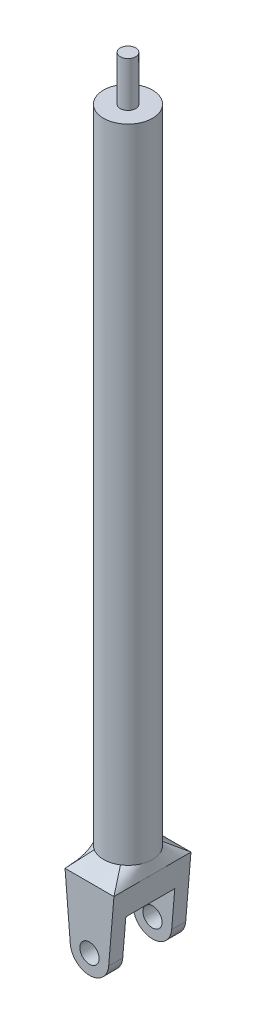
ISO-10303-21;
HEADER;
FILE_DESCRIPTION(('STEP AP214'),'2;1');
FILE_NAME('part.step','',(''),(''),'','','');
FILE_SCHEMA(('AUTOMOTIVE_DESIGN { 1 0 10303 214 1 1 1 1 }'));
ENDSEC;
DATA;
#1=APPLICATION_CONTEXT('core data for automotive mechanical design processes');
#2=APPLICATION_PROTOCOL_DEFINITION('international standard','automotive_design',2000,#1);
#3=PRODUCT_CONTEXT('',#1,'mechanical');
#4=PRODUCT('Part','Part','',(#3));
#5=PRODUCT_RELATED_PRODUCT_CATEGORY('part','',(#4));
#6=PRODUCT_DEFINITION_FORMATION('','',#4);
#7=PRODUCT_DEFINITION_CONTEXT('part definition',#1,'design');
#8=PRODUCT_DEFINITION('design','',#6,#7);
#9=PRODUCT_DEFINITION_SHAPE('','',#8);
#10=(LENGTH_UNIT() NAMED_UNIT(*) SI_UNIT(.MILLI.,.METRE.));
#11=(NAMED_UNIT(*) PLANE_ANGLE_UNIT() SI_UNIT($,.RADIAN.));
#12=(NAMED_UNIT(*) SI_UNIT($,.STERADIAN.) SOLID_ANGLE_UNIT());
#13=UNCERTAINTY_MEASURE_WITH_UNIT(LENGTH_MEASURE(1.E-05),#10,'distance_accuracy_value','');
#14=(GEOMETRIC_REPRESENTATION_CONTEXT(3) GLOBAL_UNCERTAINTY_ASSIGNED_CONTEXT((#13)) GLOBAL_UNIT_ASSIGNED_CONTEXT((#10,
#11,#12)) REPRESENTATION_CONTEXT('',''));
#15=CARTESIAN_POINT('',(0.,0.,0.));
#16=DIRECTION('',(0.,0.,1.));
#17=DIRECTION('',(1.,0.,0.));
#18=AXIS2_PLACEMENT_3D('',#15,#16,#17);
#19=CARTESIAN_POINT('',(0.,535.,0.));
#20=DIRECTION('',(0.,1.,0.));
#21=DIRECTION('',(0.,0.,1.));
#22=AXIS2_PLACEMENT_3D('',#19,#20,#21);
#23=PLANE('',#22);
#24=CARTESIAN_POINT('',(0.,535.,0.));
#25=DIRECTION('',(0.,-1.,0.));
#26=DIRECTION('',(0.,0.,-1.));
#27=AXIS2_PLACEMENT_3D('',#24,#25,#26);
#28=CIRCLE('',#27,6.00000000000001);
#29=CARTESIAN_POINT('',(0.,535.,-6.00000000000001));
#30=VERTEX_POINT('',#29);
#31=EDGE_CURVE('E12',#30,#30,#28,.T.);
#32=ORIENTED_EDGE('',*,*,#31,.F.);
#33=EDGE_LOOP('',(#32));
#34=FACE_BOUND('',#33,.T.);
#35=ADVANCED_FACE('F61',(#34),#23,.T.);
#36=CARTESIAN_POINT('',(0.,0.,0.));
#37=DIRECTION('',(0.,-1.,0.));
#38=DIRECTION('',(0.,0.,-1.));
#39=AXIS2_PLACEMENT_3D('',#36,#37,#38);
#40=CYLINDRICAL_SURFACE('',#39,6.00000000000001);
#41=ORIENTED_EDGE('',*,*,#31,.T.);
#42=EDGE_LOOP('',(#41));
#43=FACE_BOUND('',#42,.T.);
#44=CARTESIAN_POINT('',(0.,500.,0.));
#45=DIRECTION('',(0.,-1.,0.));
#46=DIRECTION('',(0.,0.,-1.));
#47=AXIS2_PLACEMENT_3D('',#44,#45,#46);
#48=CIRCLE('',#47,6.00000000000002);
#49=CARTESIAN_POINT('',(0.,500.,-6.00000000000002));
#50=VERTEX_POINT('',#49);
#51=EDGE_CURVE('E70',#50,#50,#48,.T.);
#52=ORIENTED_EDGE('',*,*,#51,.F.);
#53=EDGE_LOOP('',(#52));
#54=FACE_BOUND('',#53,.T.);
#55=ADVANCED_FACE('F470',(#43,#54),#40,.T.);
#56=CARTESIAN_POINT('',(6.00000000000002,500.,0.));
#57=DIRECTION('',(0.,1.,0.));
#58=DIRECTION('',(0.,0.,1.));
#59=AXIS2_PLACEMENT_3D('',#56,#57,#58);
#60=PLANE('',#59);
#61=ORIENTED_EDGE('',*,*,#51,.T.);
#62=EDGE_LOOP('',(#61));
#63=FACE_BOUND('',#62,.T.);
#64=CARTESIAN_POINT('',(0.,500.,0.));
#65=DIRECTION('',(0.,-1.,0.));
#66=DIRECTION('',(0.,0.,-1.));
#67=AXIS2_PLACEMENT_3D('',#64,#65,#66);
#68=CIRCLE('',#67,19.05);
#69=CARTESIAN_POINT('',(0.,500.,-19.05));
#70=VERTEX_POINT('',#69);
#71=EDGE_CURVE('E399',#70,#70,#68,.T.);
#72=ORIENTED_EDGE('',*,*,#71,.F.);
#73=EDGE_LOOP('',(#72));
#74=FACE_BOUND('',#73,.T.);
#75=ADVANCED_FACE('F251',(#63,#74),#60,.T.);
#76=CARTESIAN_POINT('',(0.,0.,0.));
#77=DIRECTION('',(0.,-1.,0.));
#78=DIRECTION('',(0.,0.,-1.));
#79=AXIS2_PLACEMENT_3D('',#76,#77,#78);
#80=CYLINDRICAL_SURFACE('',#79,19.05);
#81=ORIENTED_EDGE('',*,*,#71,.T.);
#82=EDGE_LOOP('',(#81));
#83=FACE_BOUND('',#82,.T.);
#84=CARTESIAN_POINT('',(10.2118646168973,0.,-16.081676562043));
#85=CARTESIAN_POINT('',(11.3431871061631,0.,-15.3632867813592));
#86=CARTESIAN_POINT('',(12.4660261977281,0.,-14.4818953203896));
#87=CARTESIAN_POINT('',(14.5680116148928,0.,-12.3652795690803));
#88=CARTESIAN_POINT('',(15.5460497003018,0.,-11.1290176336145));
#89=CARTESIAN_POINT('',(17.2041251482103,0.,-8.33983049337774));
#90=CARTESIAN_POINT('',(17.8822228053126,0.,-6.78686541606789));
#91=CARTESIAN_POINT('',(18.8059817453631,0.,-3.48862225351627));
#92=CARTESIAN_POINT('',(19.05,0.,-1.74491009896212));
#93=CARTESIAN_POINT('',(19.05,0.,1.74491009896212));
#94=CARTESIAN_POINT('',(18.8059817453631,0.,3.48862225351627));
#95=CARTESIAN_POINT('',(17.8822228053126,0.,6.78686541606789));
#96=CARTESIAN_POINT('',(17.2041251482103,0.,8.33983049337774));
#97=CARTESIAN_POINT('',(15.5460497003018,0.,11.1290176336145));
#98=CARTESIAN_POINT('',(14.5680116148928,0.,12.3652795690803));
#99=CARTESIAN_POINT('',(12.4660261977281,0.,14.4818953203896));
#100=CARTESIAN_POINT('',(11.3431871061631,0.,15.3632867813592));
#101=CARTESIAN_POINT('',(10.2118646168973,0.,16.081676562043));
#102=B_SPLINE_CURVE_WITH_KNOTS('',3,(#84,#85,#86,#87,#88,#89,#90,#91,#92,#93,#94,#95,#96,#97,
#98,#99,#100,#101),.UNSPECIFIED.,.F.,.F.,(4,2,2,2,2,2,2,2,4),(0.,0.125,0.25,0.375,0.5,0.625,
0.75,0.875,1.),.UNSPECIFIED.);
#103=CARTESIAN_POINT('',(10.212798921421,0.,-16.0831521547243));
#104=VERTEX_POINT('',#103);
#105=CARTESIAN_POINT('',(10.2127939620081,0.,16.0831447036037));
#106=VERTEX_POINT('',#105);
#107=EDGE_CURVE('E239',#104,#106,#102,.T.);
#108=ORIENTED_EDGE('',*,*,#107,.F.);
#109=CARTESIAN_POINT('',(-10.2118625327599,0.,-16.08167788547));
#110=CARTESIAN_POINT('',(-9.9103022956757,-1.77030877262962E-05,-16.2731819255062));
#111=CARTESIAN_POINT('',(-9.60334529303369,-0.000111724875320894,-16.4561837942627));
#112=CARTESIAN_POINT('',(-8.97964646000987,-0.000319295086165796,-16.8046402712615));
#113=CARTESIAN_POINT('',(-8.66290508212494,-0.000432842607517498,-16.9700956894083));
#114=CARTESIAN_POINT('',(-8.02062328957559,-0.000546378836732187,-17.2829316376771));
#115=CARTESIAN_POINT('',(-7.69508301533167,-0.000546369355768727,-17.4303124560417));
#116=CARTESIAN_POINT('',(-7.03653073271485,-0.000426982292556745,-17.7064141484739));
#117=CARTESIAN_POINT('',(-6.7035256498919,-0.000307711212491205,-17.8351515539269));
#118=CARTESIAN_POINT('',(-6.03079427158248,-9.89131884952009E-05,-18.0737205550378));
#119=CARTESIAN_POINT('',(-5.69106805425552,-9.3858988918205E-06,-18.1835523704034));
#120=CARTESIAN_POINT('',(-5.17731096160236,3.77917307058388E-06,-18.3338429196899));
#121=CARTESIAN_POINT('',(-5.00536562632922,-1.20193864252876E-05,-18.3815298553339));
#122=CARTESIAN_POINT('',(-4.66016985090057,-3.72723361843981E-05,-18.4720645954542));
#123=CARTESIAN_POINT('',(-4.48691913144452,-4.67253273846111E-05,-18.5149113310384));
#124=CARTESIAN_POINT('',(-3.79159510702793,-5.5417459540569E-05,-18.6765320509707));
#125=CARTESIAN_POINT('',(-3.2648334444383,3.57663684478454E-06,-18.7757863667498));
#126=CARTESIAN_POINT('',(-2.20477242414847,-3.66884300591836E-06,-18.9295635408075));
#127=CARTESIAN_POINT('',(-1.67147221414914,-6.99249217863863E-05,-18.9840805032847));
#128=CARTESIAN_POINT('',(-0.869554771441041,-4.87934567427622E-05,-19.0320304268959));
#129=CARTESIAN_POINT('',(-0.601857857036039,-2.1643115947873E-05,-19.0423745981335));
#130=CARTESIAN_POINT('',(-0.0663252022312551,1.207954298781E-07,-19.0517657835246));
#131=CARTESIAN_POINT('',(0.201510477854582,-5.25647462074756E-06,-19.0508159778472));
#132=CARTESIAN_POINT('',(0.736918396574215,-3.26184824141355E-05,-19.0376251985665));
#133=CARTESIAN_POINT('',(1.00449061513853,-5.46044000852476E-05,-19.0253834227338));
#134=CARTESIAN_POINT('',(1.53890182152094,-6.28320287415916E-05,-18.9896288081355));
#135=CARTESIAN_POINT('',(1.80574075401333,-4.90711129752488E-05,-18.9661151411915));
#136=CARTESIAN_POINT('',(2.33831836858899,-1.69238133438259E-05,-18.9078439072871));
#137=CARTESIAN_POINT('',(2.60405645648282,1.46480317090604E-06,-18.8730809107295));
#138=CARTESIAN_POINT('',(3.13382488362219,-4.24100184371356E-06,-18.7923769748039));
#139=CARTESIAN_POINT('',(3.39785525353507,-2.83346583353369E-05,-18.7464362367421));
#140=CARTESIAN_POINT('',(3.92377697440556,-5.46850118493969E-05,-18.643451453911));
#141=CARTESIAN_POINT('',(4.1856680484544,-5.69389253398732E-05,-18.5864059947614));
#142=CARTESIAN_POINT('',(4.70680930861173,-3.23567169359808E-05,-18.461317909064));
#143=CARTESIAN_POINT('',(4.96605949169064,-5.52056167364966E-06,-18.3932752699018));
#144=CARTESIAN_POINT('',(5.48117999863526,-2.41254982072625E-06,-18.2463915837317));
#145=CARTESIAN_POINT('',(5.73705372938021,-2.60850559501439E-05,-18.1675625079309));
#146=CARTESIAN_POINT('',(6.24523517897889,-0.000149317072366539,-17.9992005835798));
#147=CARTESIAN_POINT('',(6.49754285484085,-0.000248877496752257,-17.909667606108));
#148=CARTESIAN_POINT('',(7.24823632401358,-0.000488662705569067,-17.6253129160402));
#149=CARTESIAN_POINT('',(7.7407479377354,-0.000570209340338722,-17.414634066686));
#150=CARTESIAN_POINT('',(8.56574397549491,-0.000463080965709333,-17.0198317026874));
#151=CARTESIAN_POINT('',(8.90312119255353,-0.00034607995413935,-16.8457973574817));
#152=CARTESIAN_POINT('',(9.56627792558923,-0.000124597372959683,-16.4782374612163));
#153=CARTESIAN_POINT('',(9.89207754561752,-2.00932728102265E-05,-16.2847481815066));
#154=CARTESIAN_POINT('',(10.2118626951942,0.,-16.0816777823242));
#155=B_SPLINE_CURVE_WITH_KNOTS('',3,(#109,#110,#111,#112,#113,#114,#115,#116,#117,#118,#119,
#120,#121,#122,#123,#124,#125,#126,#127,#128,#129,#130,#131,#132,#133,#134,#135,#136,#137,#138,
#139,#140,#141,#142,#143,#144,#145,#146,#147,#148,#149,#150,#151,#152,#153,#154),.UNSPECIFIED.,
.F.,.F.,(4,2,2,2,2,2,2,2,2,2,2,2,2,2,2,2,2,2,2,2,2,2,4),(0.,1.07154172193501,2.14303396237388,
3.21450911308367,4.28502827611128,5.35553499746885,5.89077816743432,6.42613930842392,
8.03215107483458,9.63837445873562,10.4418645106763,11.2451283204481,12.0484492018677,
12.8518291146441,13.6555973662837,14.4593511434916,15.2632073598585,16.0670644982951,
16.8700366136108,17.6730184011829,19.2778767329921,20.4161178557713,21.5522748878077),.UNSPECIFIED.);
#156=CARTESIAN_POINT('',(-10.2127939620083,0.,-16.0831447036041));
#157=VERTEX_POINT('',#156);
#158=EDGE_CURVE('E236',#157,#104,#155,.T.);
#159=ORIENTED_EDGE('',*,*,#158,.F.);
#160=CARTESIAN_POINT('',(0.,0.,0.));
#161=DIRECTION('',(0.,-1.,0.));
#162=DIRECTION('',(0.,0.,-1.));
#163=AXIS2_PLACEMENT_3D('',#160,#161,#162);
#164=CIRCLE('',#163,19.05);
#165=CARTESIAN_POINT('',(-10.2127989214209,0.,16.0831521547242));
#166=VERTEX_POINT('',#165);
#167=EDGE_CURVE('E78',#166,#157,#164,.T.);
#168=ORIENTED_EDGE('',*,*,#167,.F.);
#169=CARTESIAN_POINT('',(10.2118625327599,0.,16.08167788547));
#170=CARTESIAN_POINT('',(9.91030229567569,-1.77030877265189E-05,16.2731819255062));
#171=CARTESIAN_POINT('',(9.60334529303368,-0.000111724875320803,16.4561837942627));
#172=CARTESIAN_POINT('',(8.97964646000986,-0.000319295086165315,16.8046402712615));
#173=CARTESIAN_POINT('',(8.66290508212493,-0.000432842607516941,16.9700956894083));
#174=CARTESIAN_POINT('',(8.02062328957558,-0.000546378836733025,17.2829316376771));
#175=CARTESIAN_POINT('',(7.69508301533166,-0.000546369355771034,17.4303124560417));
#176=CARTESIAN_POINT('',(7.03653073271485,-0.000426982292563053,17.7064141484739));
#177=CARTESIAN_POINT('',(6.7035256498919,-0.000307711212500043,17.8351515539269));
#178=CARTESIAN_POINT('',(6.03079427158247,-9.89131884990949E-05,18.0737205550378));
#179=CARTESIAN_POINT('',(5.69106805425552,-9.38589888824091E-06,18.1835523704034));
#180=CARTESIAN_POINT('',(5.17731096160235,3.77917307312413E-06,18.3338429196899));
#181=CARTESIAN_POINT('',(5.00536562632921,-1.20193864251353E-05,18.381529855334));
#182=CARTESIAN_POINT('',(4.66016985090056,-3.72723361852877E-05,18.4720645954542));
#183=CARTESIAN_POINT('',(4.48691913144451,-4.67253273841538E-05,18.5149113310384));
#184=CARTESIAN_POINT('',(3.79159510702791,-5.54174595374999E-05,18.6765320509707));
#185=CARTESIAN_POINT('',(3.26483344443829,3.57663684356756E-06,18.7757863667498));
#186=CARTESIAN_POINT('',(2.20477242414846,-3.66884300481145E-06,18.9295635408075));
#187=CARTESIAN_POINT('',(1.67147221414912,-6.99249217786681E-05,18.9840805032847));
#188=CARTESIAN_POINT('',(0.869554771441027,-4.87934567402223E-05,19.0320304268959));
#189=CARTESIAN_POINT('',(0.601857857036026,-2.1643115949578E-05,19.0423745981335));
#190=CARTESIAN_POINT('',(0.0663252022312416,1.20795425579327E-07,19.0517657835246));
#191=CARTESIAN_POINT('',(-0.201510477854596,-5.25647462339694E-06,19.0508159778472));
#192=CARTESIAN_POINT('',(-0.736918396574229,-3.26184824136698E-05,19.0376251985665));
#193=CARTESIAN_POINT('',(-1.00449061513854,-5.46044000833162E-05,19.0253834227338));
#194=CARTESIAN_POINT('',(-1.53890182152095,-6.28320287402082E-05,18.9896288081355));
#195=CARTESIAN_POINT('',(-1.80574075401335,-4.90711129758794E-05,18.9661151411915));
#196=CARTESIAN_POINT('',(-2.33831836858901,-1.69238133454159E-05,18.9078439072871));
#197=CARTESIAN_POINT('',(-2.60405645648283,1.46480317037203E-06,18.8730809107295));
#198=CARTESIAN_POINT('',(-3.1338248836222,-4.24100184551506E-06,18.7923769748039));
#199=CARTESIAN_POINT('',(-3.39785525353508,-2.83346583394618E-05,18.7464362367421));
#200=CARTESIAN_POINT('',(-3.92377697440557,-5.46850118540102E-05,18.643451453911));
#201=CARTESIAN_POINT('',(-4.18566804845441,-5.69389253426508E-05,18.5864059947614));
#202=CARTESIAN_POINT('',(-4.70680930861174,-3.23567169364299E-05,18.461317909064));
#203=CARTESIAN_POINT('',(-4.96605949169065,-5.52056167360593E-06,18.3932752699018));
#204=CARTESIAN_POINT('',(-5.48117999863527,-2.41254982337532E-06,18.2463915837317));
#205=CARTESIAN_POINT('',(-5.73705372938022,-2.60850559559745E-05,18.1675625079309));
#206=CARTESIAN_POINT('',(-6.2452351789789,-0.00014931707237117,17.9992005835798));
#207=CARTESIAN_POINT('',(-6.49754285484086,-0.000248877496752506,17.909667606108));
#208=CARTESIAN_POINT('',(-7.24823632401359,-0.000488662705563865,17.6253129160402));
#209=CARTESIAN_POINT('',(-7.74074793773541,-0.000570209340340123,17.414634066686));
#210=CARTESIAN_POINT('',(-8.56574397549492,-0.000463080965712135,17.0198317026874));
#211=CARTESIAN_POINT('',(-8.90312119255354,-0.000346079954139825,16.8457973574817));
#212=CARTESIAN_POINT('',(-9.56627792558922,-0.000124597372956992,16.4782374612163));
#213=CARTESIAN_POINT('',(-9.89207754561752,-2.00932728066956E-05,16.2847481815066));
#214=CARTESIAN_POINT('',(-10.2118626951942,0.,16.0816777823242));
#215=B_SPLINE_CURVE_WITH_KNOTS('',3,(#169,#170,#171,#172,#173,#174,#175,#176,#177,#178,#179,
#180,#181,#182,#183,#184,#185,#186,#187,#188,#189,#190,#191,#192,#193,#194,#195,#196,#197,#198,
#199,#200,#201,#202,#203,#204,#205,#206,#207,#208,#209,#210,#211,#212,#213,#214),.UNSPECIFIED.,
.F.,.F.,(4,2,2,2,2,2,2,2,2,2,2,2,2,2,2,2,2,2,2,2,2,2,4),(0.,1.071541721935,2.14303396237388,
3.21450911308367,4.28502827611127,5.35553499746885,5.89077816743432,6.42613930842392,
8.03215107483458,9.63837445873563,10.4418645106763,11.2451283204481,12.0484492018677,
12.8518291146441,13.6555973662837,14.4593511434916,15.2632073598585,16.0670644982951,
16.8700366136108,17.6730184011829,19.2778767329921,20.4161178557713,21.5522748878076),.UNSPECIFIED.);
#216=EDGE_CURVE('E84',#106,#166,#215,.T.);
#217=ORIENTED_EDGE('',*,*,#216,.F.);
#218=EDGE_LOOP('',(#108,#159,#168,#217));
#219=FACE_BOUND('',#218,.T.);
#220=ADVANCED_FACE('F246',(#83,#219),#80,.T.);
#221=CARTESIAN_POINT('',(19.05,-10.,-30.));
#222=CARTESIAN_POINT('',(10.2118646168973,0.,-16.081676562043));
#223=CARTESIAN_POINT('',(10.1234832630662,0.100000000000001,-15.9424933276634));
#224=CARTESIAN_POINT('',(15.875,-10.,-30.));
#225=CARTESIAN_POINT('',(8.77508505552971,0.,-16.9940315835114));
#226=CARTESIAN_POINT('',(8.70408590608501,0.100000000000001,-16.8639718993465));
#227=CARTESIAN_POINT('',(12.7,-10.,-30.));
#228=CARTESIAN_POINT('',(7.15560932636086,0.,-17.7473143466663));
#229=CARTESIAN_POINT('',(7.10016541962447,0.100000000000001,-17.6247874901329));
#230=CARTESIAN_POINT('',(7.93749999999996,-10.,-30.));
#231=CARTESIAN_POINT('',(4.55638735911084,0.,-18.5191437996322));
#232=CARTESIAN_POINT('',(4.52257623270195,0.100000000000001,-18.4043352376286));
#233=CARTESIAN_POINT('',(6.34999999999996,-10.,-30.));
#234=CARTESIAN_POINT('',(3.66252312581302,0.,-18.7171372137086));
#235=CARTESIAN_POINT('',(3.63564835707115,0.100000000000001,-18.6043085858457));
#236=CARTESIAN_POINT('',(3.17499999999996,-10.,-30.));
#237=CARTESIAN_POINT('',(1.84572890734522,0.,-18.9825863865939));
#238=CARTESIAN_POINT('',(1.83243619641867,0.100000000000001,-18.8724122504599));
#239=CARTESIAN_POINT('',(1.58749999999996,-10.,-30.));
#240=CARTESIAN_POINT('',(0.922889919625383,0.,-19.05));
#241=CARTESIAN_POINT('',(0.916243818821637,0.100000000000001,-18.9405));
#242=CARTESIAN_POINT('',(-1.58750000000004,-10.,-30.));
#243=CARTESIAN_POINT('',(-0.922889919625389,0.,-19.05));
#244=CARTESIAN_POINT('',(-0.916243818821642,0.100000000000001,-18.9405));
#245=CARTESIAN_POINT('',(-3.17500000000004,-10.,-30.));
#246=CARTESIAN_POINT('',(-1.84572890734522,0.,-18.9825863865939));
#247=CARTESIAN_POINT('',(-1.83243619641867,0.100000000000001,-18.8724122504599));
#248=CARTESIAN_POINT('',(-6.35000000000003,-10.,-30.));
#249=CARTESIAN_POINT('',(-3.66252312581303,0.,-18.7171372137086));
#250=CARTESIAN_POINT('',(-3.63564835707116,0.100000000000001,-18.6043085858457));
#251=CARTESIAN_POINT('',(-7.93750000000003,-10.,-30.));
#252=CARTESIAN_POINT('',(-4.55638735911085,0.,-18.5191437996322));
#253=CARTESIAN_POINT('',(-4.52257623270196,0.100000000000001,-18.4043352376286));
#254=CARTESIAN_POINT('',(-12.7,-10.,-30.));
#255=CARTESIAN_POINT('',(-7.15560932636086,0.,-17.7473143466663));
#256=CARTESIAN_POINT('',(-7.10016541962447,0.100000000000001,-17.624787490133));
#257=CARTESIAN_POINT('',(-15.875,-10.,-30.));
#258=CARTESIAN_POINT('',(-8.77508505552971,0.,-16.9940315835114));
#259=CARTESIAN_POINT('',(-8.70408590608501,0.100000000000001,-16.8639718993465));
#260=CARTESIAN_POINT('',(-19.05,-10.,-30.));
#261=CARTESIAN_POINT('',(-10.2118646168973,0.,-16.081676562043));
#262=CARTESIAN_POINT('',(-10.1234832630663,0.100000000000001,-15.9424933276634));
#263=B_SPLINE_SURFACE_WITH_KNOTS('',3,1,((#221,#222,#223),(#224,#225,#226),(#227,#228,#229),
(#230,#231,#232),(#233,#234,#235),(#236,#237,#238),(#239,#240,#241),(#242,#243,#244),(#245,#246,
#247),(#248,#249,#250),(#251,#252,#253),(#254,#255,#256),(#257,#258,#259),(#260,#261,#262)),
.UNSPECIFIED.,.F.,.F.,.F.,(4,2,2,2,2,2,4),(2,1,2),(0.,0.25,0.375,0.5,0.625,0.75,1.),(0.,1.,
1.01),.UNSPECIFIED.);
#264=DIRECTION('',(-1.,0.,0.));
#265=VECTOR('',#264,1.);
#266=CARTESIAN_POINT('',(-19.05,-10.,-30.));
#267=LINE('',#266,#265);
#268=CARTESIAN_POINT('',(19.05,-10.,-30.));
#269=VERTEX_POINT('',#268);
#270=CARTESIAN_POINT('',(-19.05,-10.,-30.));
#271=VERTEX_POINT('',#270);
#272=EDGE_CURVE('E64',#269,#271,#267,.T.);
#273=DIRECTION('',(0.458339256314959,0.518592708130767,0.721794104433007));
#274=VECTOR('',#273,1.);
#275=CARTESIAN_POINT('',(-14.6309323084486,-5.,-23.0408382810215));
#276=LINE('',#275,#274);
#277=EDGE_CURVE('E286',#271,#157,#276,.T.);
#278=DIRECTION('',(0.458339256314959,-0.518592708130767,-0.721794104433008));
#279=VECTOR('',#278,1.);
#280=CARTESIAN_POINT('',(14.6309323084486,-5.,-23.0408382810215));
#281=LINE('',#280,#279);
#282=EDGE_CURVE('E295',#104,#269,#281,.T.);
#283=ORIENTED_EDGE('',*,*,#272,.T.);
#284=ORIENTED_EDGE('',*,*,#277,.T.);
#285=ORIENTED_EDGE('',*,*,#158,.T.);
#286=ORIENTED_EDGE('',*,*,#282,.T.);
#287=EDGE_LOOP('',(#283,#284,#285,#286));
#288=FACE_BOUND('',#287,.T.);
#289=ADVANCED_FACE('F250',(#288),#263,.T.);
#290=CARTESIAN_POINT('',(-19.05,-10.,-30.));
#291=CARTESIAN_POINT('',(-10.2118646168973,0.,-16.081676562043));
#292=CARTESIAN_POINT('',(-19.05,-10.,-27.5));
#293=CARTESIAN_POINT('',(-11.3431871061631,0.,-15.3632867813592));
#294=CARTESIAN_POINT('',(-19.05,-10.,-25.));
#295=CARTESIAN_POINT('',(-12.4660261977281,0.,-14.4818953203896));
#296=CARTESIAN_POINT('',(-19.05,-10.,-20.));
#297=CARTESIAN_POINT('',(-14.5680116148928,0.,-12.3652795690803));
#298=CARTESIAN_POINT('',(-19.05,-10.,-17.5));
#299=CARTESIAN_POINT('',(-15.5460497003018,0.,-11.1290176336145));
#300=CARTESIAN_POINT('',(-19.05,-10.,-12.5));
#301=CARTESIAN_POINT('',(-17.2041251482103,0.,-8.33983049337774));
#302=CARTESIAN_POINT('',(-19.05,-10.,-9.99999999999999));
#303=CARTESIAN_POINT('',(-17.8822228053126,0.,-6.78686541606789));
#304=CARTESIAN_POINT('',(-19.05,-10.,-4.99999999999999));
#305=CARTESIAN_POINT('',(-18.8059817453631,0.,-3.48862225351627));
#306=CARTESIAN_POINT('',(-19.05,-10.,-2.49999999999999));
#307=CARTESIAN_POINT('',(-19.05,0.,-1.74491009896212));
#308=CARTESIAN_POINT('',(-19.05,-10.,2.50000000000001));
#309=CARTESIAN_POINT('',(-19.05,0.,1.74491009896212));
#310=CARTESIAN_POINT('',(-19.05,-10.,5.00000000000001));
#311=CARTESIAN_POINT('',(-18.8059817453631,0.,3.48862225351628));
#312=CARTESIAN_POINT('',(-19.05,-10.,10.));
#313=CARTESIAN_POINT('',(-17.8822228053126,0.,6.7868654160679));
#314=CARTESIAN_POINT('',(-19.05,-10.,12.5));
#315=CARTESIAN_POINT('',(-17.2041251482103,0.,8.33983049337774));
#316=CARTESIAN_POINT('',(-19.05,-10.,17.5));
#317=CARTESIAN_POINT('',(-15.5460497003018,0.,11.1290176336145));
#318=CARTESIAN_POINT('',(-19.05,-10.,20.));
#319=CARTESIAN_POINT('',(-14.5680116148928,0.,12.3652795690803));
#320=CARTESIAN_POINT('',(-19.05,-10.,25.));
#321=CARTESIAN_POINT('',(-12.4660261977281,0.,14.4818953203896));
#322=CARTESIAN_POINT('',(-19.05,-10.,27.5));
#323=CARTESIAN_POINT('',(-11.3431871061631,0.,15.3632867813592));
#324=CARTESIAN_POINT('',(-19.05,-10.,30.));
#325=CARTESIAN_POINT('',(-10.2118646168973,0.,16.081676562043));
#326=B_SPLINE_SURFACE_WITH_KNOTS('',3,1,((#290,#291),(#292,#293),(#294,#295),(#296,#297),(#298,
#299),(#300,#301),(#302,#303),(#304,#305),(#306,#307),(#308,#309),(#310,#311),(#312,#313),(#314,
#315),(#316,#317),(#318,#319),(#320,#321),(#322,#323),(#324,#325)),.UNSPECIFIED.,.F.,.F.,.F.,(4,
2,2,2,2,2,2,2,4),(2,2),(0.,0.125,0.25,0.375,0.5,0.625,0.75,0.875,1.),(0.,1.),.UNSPECIFIED.);
#327=DIRECTION('',(0.,0.,-1.));
#328=VECTOR('',#327,1.);
#329=CARTESIAN_POINT('',(-19.05,-10.,30.));
#330=LINE('',#329,#328);
#331=CARTESIAN_POINT('',(-19.05,-10.,30.));
#332=VERTEX_POINT('',#331);
#333=EDGE_CURVE('E171',#332,#271,#330,.T.);
#334=DIRECTION('',(0.45833925631496,0.518592708130767,-0.721794104433007));
#335=VECTOR('',#334,1.);
#336=CARTESIAN_POINT('',(-14.6309323084486,-5.,23.0408382810215));
#337=LINE('',#336,#335);
#338=EDGE_CURVE('E294',#332,#166,#337,.T.);
#339=ORIENTED_EDGE('',*,*,#333,.F.);
#340=ORIENTED_EDGE('',*,*,#338,.T.);
#341=ORIENTED_EDGE('',*,*,#167,.T.);
#342=ORIENTED_EDGE('',*,*,#277,.F.);
#343=EDGE_LOOP('',(#339,#340,#341,#342));
#344=FACE_BOUND('',#343,.T.);
#345=ADVANCED_FACE('F205',(#344),#326,.T.);
#346=CARTESIAN_POINT('',(19.05,-10.,30.));
#347=CARTESIAN_POINT('',(10.2118646168973,0.,16.081676562043));
#348=CARTESIAN_POINT('',(19.05,-10.,27.5));
#349=CARTESIAN_POINT('',(11.3431871061631,0.,15.3632867813592));
#350=CARTESIAN_POINT('',(19.05,-10.,25.));
#351=CARTESIAN_POINT('',(12.4660261977281,0.,14.4818953203896));
#352=CARTESIAN_POINT('',(19.05,-10.,20.));
#353=CARTESIAN_POINT('',(14.5680116148928,0.,12.3652795690803));
#354=CARTESIAN_POINT('',(19.05,-10.,17.5));
#355=CARTESIAN_POINT('',(15.5460497003018,0.,11.1290176336145));
#356=CARTESIAN_POINT('',(19.05,-10.,12.5000000000001));
#357=CARTESIAN_POINT('',(17.2041251482103,0.,8.33983049337774));
#358=CARTESIAN_POINT('',(19.05,-10.,10.0000000000001));
#359=CARTESIAN_POINT('',(17.8822228053126,0.,6.78686541606789));
#360=CARTESIAN_POINT('',(19.05,-10.,5.00000000000006));
#361=CARTESIAN_POINT('',(18.8059817453631,0.,3.48862225351627));
#362=CARTESIAN_POINT('',(19.05,-10.,2.50000000000006));
#363=CARTESIAN_POINT('',(19.05,0.,1.74491009896212));
#364=CARTESIAN_POINT('',(19.05,-10.,-2.49999999999994));
#365=CARTESIAN_POINT('',(19.05,0.,-1.74491009896212));
#366=CARTESIAN_POINT('',(19.05,-10.,-4.99999999999994));
#367=CARTESIAN_POINT('',(18.8059817453631,0.,-3.48862225351627));
#368=CARTESIAN_POINT('',(19.05,-10.,-9.99999999999994));
#369=CARTESIAN_POINT('',(17.8822228053126,0.,-6.78686541606789));
#370=CARTESIAN_POINT('',(19.05,-10.,-12.4999999999999));
#371=CARTESIAN_POINT('',(17.2041251482103,0.,-8.33983049337774));
#372=CARTESIAN_POINT('',(19.05,-10.,-17.5));
#373=CARTESIAN_POINT('',(15.5460497003018,0.,-11.1290176336145));
#374=CARTESIAN_POINT('',(19.05,-10.,-20.));
#375=CARTESIAN_POINT('',(14.5680116148928,0.,-12.3652795690803));
#376=CARTESIAN_POINT('',(19.05,-10.,-25.));
#377=CARTESIAN_POINT('',(12.4660261977281,0.,-14.4818953203896));
#378=CARTESIAN_POINT('',(19.05,-10.,-27.5));
#379=CARTESIAN_POINT('',(11.3431871061631,0.,-15.3632867813592));
#380=CARTESIAN_POINT('',(19.05,-10.,-30.));
#381=CARTESIAN_POINT('',(10.2118646168973,0.,-16.081676562043));
#382=B_SPLINE_SURFACE_WITH_KNOTS('',3,1,((#346,#347),(#348,#349),(#350,#351),(#352,#353),(#354,
#355),(#356,#357),(#358,#359),(#360,#361),(#362,#363),(#364,#365),(#366,#367),(#368,#369),(#370,
#371),(#372,#373),(#374,#375),(#376,#377),(#378,#379),(#380,#381)),.UNSPECIFIED.,.F.,.F.,.F.,(4,
2,2,2,2,2,2,2,4),(2,2),(0.,0.125,0.25,0.375,0.5,0.625,0.75,0.875,1.),(0.,1.),.UNSPECIFIED.);
#383=DIRECTION('',(0.,0.,-1.));
#384=VECTOR('',#383,1.);
#385=CARTESIAN_POINT('',(19.05,-10.,30.));
#386=LINE('',#385,#384);
#387=CARTESIAN_POINT('',(19.05,-10.,30.));
#388=VERTEX_POINT('',#387);
#389=EDGE_CURVE('E184',#388,#269,#386,.T.);
#390=DIRECTION('',(-0.458339256314959,0.518592708130767,-0.721794104433008));
#391=VECTOR('',#390,1.);
#392=CARTESIAN_POINT('',(14.6309323084486,-5.,23.0408382810215));
#393=LINE('',#392,#391);
#394=EDGE_CURVE('E190',#388,#106,#393,.T.);
#395=ORIENTED_EDGE('',*,*,#389,.T.);
#396=ORIENTED_EDGE('',*,*,#282,.F.);
#397=ORIENTED_EDGE('',*,*,#107,.T.);
#398=ORIENTED_EDGE('',*,*,#394,.F.);
#399=EDGE_LOOP('',(#395,#396,#397,#398));
#400=FACE_BOUND('',#399,.T.);
#401=ADVANCED_FACE('F192',(#400),#382,.T.);
#402=CARTESIAN_POINT('',(-19.05,-10.,30.));
#403=CARTESIAN_POINT('',(-10.2118646168973,0.,16.081676562043));
#404=CARTESIAN_POINT('',(-10.1234832630662,0.100000000000001,15.9424933276634));
#405=CARTESIAN_POINT('',(-15.875,-10.,30.));
#406=CARTESIAN_POINT('',(-8.77508505552971,0.,16.9940315835114));
#407=CARTESIAN_POINT('',(-8.70408590608501,0.100000000000001,16.8639718993465));
#408=CARTESIAN_POINT('',(-12.7,-10.,30.));
#409=CARTESIAN_POINT('',(-7.15560932636086,0.,17.7473143466663));
#410=CARTESIAN_POINT('',(-7.10016541962446,0.100000000000001,17.6247874901329));
#411=CARTESIAN_POINT('',(-7.93750000000001,-10.,30.));
#412=CARTESIAN_POINT('',(-4.55638735911084,0.,18.5191437996322));
#413=CARTESIAN_POINT('',(-4.52257623270195,0.100000000000001,18.4043352376286));
#414=CARTESIAN_POINT('',(-6.35000000000001,-10.,30.));
#415=CARTESIAN_POINT('',(-3.66252312581302,0.,18.7171372137086));
#416=CARTESIAN_POINT('',(-3.63564835707115,0.100000000000001,18.6043085858457));
#417=CARTESIAN_POINT('',(-3.17500000000001,-10.,30.));
#418=CARTESIAN_POINT('',(-1.84572890734521,0.,18.9825863865939));
#419=CARTESIAN_POINT('',(-1.83243619641867,0.100000000000001,18.8724122504599));
#420=CARTESIAN_POINT('',(-1.58750000000001,-10.,30.));
#421=CARTESIAN_POINT('',(-0.922889919625384,0.,19.05));
#422=CARTESIAN_POINT('',(-0.916243818821637,0.100000000000001,18.9405));
#423=CARTESIAN_POINT('',(1.58749999999999,-10.,30.));
#424=CARTESIAN_POINT('',(0.922889919625388,0.,19.05));
#425=CARTESIAN_POINT('',(0.916243818821642,0.100000000000001,18.9405));
#426=CARTESIAN_POINT('',(3.17499999999999,-10.,30.));
#427=CARTESIAN_POINT('',(1.84572890734522,0.,18.9825863865939));
#428=CARTESIAN_POINT('',(1.83243619641867,0.100000000000001,18.8724122504599));
#429=CARTESIAN_POINT('',(6.34999999999999,-10.,30.));
#430=CARTESIAN_POINT('',(3.66252312581302,0.,18.7171372137086));
#431=CARTESIAN_POINT('',(3.63564835707115,0.100000000000001,18.6043085858457));
#432=CARTESIAN_POINT('',(7.93749999999999,-10.,30.));
#433=CARTESIAN_POINT('',(4.55638735911085,0.,18.5191437996322));
#434=CARTESIAN_POINT('',(4.52257623270196,0.100000000000001,18.4043352376286));
#435=CARTESIAN_POINT('',(12.7,-10.,30.));
#436=CARTESIAN_POINT('',(7.15560932636086,0.,17.7473143466663));
#437=CARTESIAN_POINT('',(7.10016541962447,0.100000000000001,17.624787490133));
#438=CARTESIAN_POINT('',(15.875,-10.,30.));
#439=CARTESIAN_POINT('',(8.77508505552971,0.,16.9940315835114));
#440=CARTESIAN_POINT('',(8.70408590608501,0.100000000000001,16.8639718993465));
#441=CARTESIAN_POINT('',(19.05,-10.,30.));
#442=CARTESIAN_POINT('',(10.2118646168973,0.,16.081676562043));
#443=CARTESIAN_POINT('',(10.1234832630662,0.100000000000001,15.9424933276634));
#444=B_SPLINE_SURFACE_WITH_KNOTS('',3,1,((#402,#403,#404),(#405,#406,#407),(#408,#409,#410),
(#411,#412,#413),(#414,#415,#416),(#417,#418,#419),(#420,#421,#422),(#423,#424,#425),(#426,#427,
#428),(#429,#430,#431),(#432,#433,#434),(#435,#436,#437),(#438,#439,#440),(#441,#442,#443)),
.UNSPECIFIED.,.F.,.F.,.F.,(4,2,2,2,2,2,4),(2,1,2),(0.,0.25,0.375,0.5,0.625,0.75,1.),(0.,1.,
1.01),.UNSPECIFIED.);
#445=DIRECTION('',(-1.,0.,0.));
#446=VECTOR('',#445,1.);
#447=CARTESIAN_POINT('',(-19.05,-10.,30.));
#448=LINE('',#447,#446);
#449=EDGE_CURVE('E317',#388,#332,#448,.T.);
#450=ORIENTED_EDGE('',*,*,#449,.F.);
#451=ORIENTED_EDGE('',*,*,#394,.T.);
#452=ORIENTED_EDGE('',*,*,#216,.T.);
#453=ORIENTED_EDGE('',*,*,#338,.F.);
#454=EDGE_LOOP('',(#450,#451,#452,#453));
#455=FACE_BOUND('',#454,.T.);
#456=ADVANCED_FACE('F204',(#455),#444,.T.);
#457=CARTESIAN_POINT('',(0.,-57.7,30.));
#458=DIRECTION('',(0.,0.,-1.));
#459=DIRECTION('',(-1.,0.,0.));
#460=AXIS2_PLACEMENT_3D('',#457,#458,#459);
#461=CYLINDRICAL_SURFACE('',#460,15.);
#462=CARTESIAN_POINT('',(0.,-57.7,-19.05));
#463=DIRECTION('',(0.,0.,-1.));
#464=DIRECTION('',(-1.,0.,0.));
#465=AXIS2_PLACEMENT_3D('',#462,#463,#464);
#466=CIRCLE('',#465,15.);
#467=CARTESIAN_POINT('',(14.9476033183098,-58.9526591868721,-19.05));
#468=VERTEX_POINT('',#467);
#469=CARTESIAN_POINT('',(-14.9476033183098,-58.9526591868721,-19.05));
#470=VERTEX_POINT('',#469);
#471=EDGE_CURVE('E447',#468,#470,#466,.T.);
#472=ORIENTED_EDGE('',*,*,#471,.T.);
#473=DIRECTION('',(0.,0.,-1.));
#474=VECTOR('',#473,1.);
#475=CARTESIAN_POINT('',(-14.9476033183098,-58.9526591868721,30.));
#476=LINE('',#475,#474);
#477=CARTESIAN_POINT('',(-14.9476033183098,-58.9526591868721,-30.));
#478=VERTEX_POINT('',#477);
#479=EDGE_CURVE('E172',#470,#478,#476,.T.);
#480=ORIENTED_EDGE('',*,*,#479,.T.);
#481=CARTESIAN_POINT('',(0.,-57.7,-30.));
#482=DIRECTION('',(0.,0.,1.));
#483=DIRECTION('',(1.,0.,0.));
#484=AXIS2_PLACEMENT_3D('',#481,#482,#483);
#485=CIRCLE('',#484,15.);
#486=CARTESIAN_POINT('',(14.9476033183098,-58.9526591868721,-30.));
#487=VERTEX_POINT('',#486);
#488=EDGE_CURVE('E349',#478,#487,#485,.T.);
#489=ORIENTED_EDGE('',*,*,#488,.T.);
#490=DIRECTION('',(0.,0.,-1.));
#491=VECTOR('',#490,1.);
#492=CARTESIAN_POINT('',(14.9476033183098,-58.9526591868721,30.));
#493=LINE('',#492,#491);
#494=EDGE_CURVE('E436',#468,#487,#493,.T.);
#495=ORIENTED_EDGE('',*,*,#494,.F.);
#496=EDGE_LOOP('',(#472,#480,#489,#495));
#497=FACE_BOUND('',#496,.T.);
#498=ADVANCED_FACE('F382',(#497),#461,.T.);
#499=CARTESIAN_POINT('',(0.,-57.7,30.));
#500=DIRECTION('',(0.,0.,-1.));
#501=DIRECTION('',(-1.,0.,0.));
#502=AXIS2_PLACEMENT_3D('',#499,#500,#501);
#503=CYLINDRICAL_SURFACE('',#502,7.5);
#504=CARTESIAN_POINT('',(0.,-57.7,-19.05));
#505=DIRECTION('',(0.,0.,-1.));
#506=DIRECTION('',(-1.,0.,0.));
#507=AXIS2_PLACEMENT_3D('',#504,#505,#506);
#508=CIRCLE('',#507,7.5);
#509=CARTESIAN_POINT('',(-7.5,-57.7,-19.05));
#510=VERTEX_POINT('',#509);
#511=EDGE_CURVE('E176',#510,#510,#508,.T.);
#512=ORIENTED_EDGE('',*,*,#511,.F.);
#513=EDGE_LOOP('',(#512));
#514=FACE_BOUND('',#513,.T.);
#515=CARTESIAN_POINT('',(0.,-57.7,-30.));
#516=DIRECTION('',(0.,0.,1.));
#517=DIRECTION('',(1.,0.,0.));
#518=AXIS2_PLACEMENT_3D('',#515,#516,#517);
#519=CIRCLE('',#518,7.5);
#520=CARTESIAN_POINT('',(7.5,-57.7,-30.));
#521=VERTEX_POINT('',#520);
#522=EDGE_CURVE('E357',#521,#521,#519,.T.);
#523=ORIENTED_EDGE('',*,*,#522,.F.);
#524=EDGE_LOOP('',(#523));
#525=FACE_BOUND('',#524,.T.);
#526=ADVANCED_FACE('F457',(#514,#525),#503,.F.);
#527=CARTESIAN_POINT('',(0.,-57.7,30.));
#528=DIRECTION('',(0.,0.,1.));
#529=DIRECTION('',(1.,0.,0.));
#530=AXIS2_PLACEMENT_3D('',#527,#528,#529);
#531=PLANE('',#530);
#532=DIRECTION('',(0.0835106124581419,0.996506887887317,0.));
#533=VECTOR('',#532,1.);
#534=CARTESIAN_POINT('',(14.9476033183098,-58.9526591868721,30.));
#535=LINE('',#534,#533);
#536=CARTESIAN_POINT('',(14.9476033183098,-58.9526591868721,30.));
#537=VERTEX_POINT('',#536);
#538=EDGE_CURVE('E351',#537,#388,#535,.T.);
#539=ORIENTED_EDGE('',*,*,#538,.T.);
#540=ORIENTED_EDGE('',*,*,#449,.T.);
#541=DIRECTION('',(0.0835106124581422,-0.996506887887317,0.));
#542=VECTOR('',#541,1.);
#543=CARTESIAN_POINT('',(-14.9476033183098,-58.9526591868721,30.));
#544=LINE('',#543,#542);
#545=CARTESIAN_POINT('',(-14.9476033183098,-58.9526591868721,30.));
#546=VERTEX_POINT('',#545);
#547=EDGE_CURVE('E343',#332,#546,#544,.T.);
#548=ORIENTED_EDGE('',*,*,#547,.T.);
#549=CARTESIAN_POINT('',(0.,-57.7,30.));
#550=DIRECTION('',(0.,0.,1.));
#551=DIRECTION('',(1.,0.,0.));
#552=AXIS2_PLACEMENT_3D('',#549,#550,#551);
#553=CIRCLE('',#552,15.);
#554=EDGE_CURVE('E438',#546,#537,#553,.T.);
#555=ORIENTED_EDGE('',*,*,#554,.T.);
#556=EDGE_LOOP('',(#539,#540,#548,#555));
#557=FACE_BOUND('',#556,.T.);
#558=CARTESIAN_POINT('',(0.,-57.7,30.));
#559=DIRECTION('',(0.,0.,1.));
#560=DIRECTION('',(1.,0.,0.));
#561=AXIS2_PLACEMENT_3D('',#558,#559,#560);
#562=CIRCLE('',#561,7.5);
#563=CARTESIAN_POINT('',(7.5,-57.7,30.));
#564=VERTEX_POINT('',#563);
#565=EDGE_CURVE('E353',#564,#564,#562,.T.);
#566=ORIENTED_EDGE('',*,*,#565,.F.);
#567=EDGE_LOOP('',(#566));
#568=FACE_BOUND('',#567,.T.);
#569=ADVANCED_FACE('F375',(#557,#568),#531,.T.);
#570=CARTESIAN_POINT('',(0.,-57.7,-30.));
#571=DIRECTION('',(0.,0.,1.));
#572=DIRECTION('',(1.,0.,0.));
#573=AXIS2_PLACEMENT_3D('',#570,#571,#572);
#574=PLANE('',#573);
#575=DIRECTION('',(0.0835106124581419,0.996506887887317,0.));
#576=VECTOR('',#575,1.);
#577=CARTESIAN_POINT('',(14.9476033183098,-58.9526591868721,-30.));
#578=LINE('',#577,#576);
#579=EDGE_CURVE('E350',#487,#269,#578,.T.);
#580=ORIENTED_EDGE('',*,*,#579,.F.);
#581=ORIENTED_EDGE('',*,*,#488,.F.);
#582=DIRECTION('',(0.0835106124581422,-0.996506887887317,0.));
#583=VECTOR('',#582,1.);
#584=CARTESIAN_POINT('',(-14.9476033183098,-58.9526591868721,-30.));
#585=LINE('',#584,#583);
#586=EDGE_CURVE('E263',#271,#478,#585,.T.);
#587=ORIENTED_EDGE('',*,*,#586,.F.);
#588=ORIENTED_EDGE('',*,*,#272,.F.);
#589=EDGE_LOOP('',(#580,#581,#587,#588));
#590=FACE_BOUND('',#589,.T.);
#591=ORIENTED_EDGE('',*,*,#522,.T.);
#592=EDGE_LOOP('',(#591));
#593=FACE_BOUND('',#592,.T.);
#594=ADVANCED_FACE('F346',(#590,#593),#574,.F.);
#595=CARTESIAN_POINT('',(14.9476033183098,-58.9526591868721,30.));
#596=DIRECTION('',(-0.996506887887317,0.0835106124581419,0.));
#597=DIRECTION('',(-0.0835106124581419,-0.996506887887317,0.));
#598=AXIS2_PLACEMENT_3D('',#595,#596,#597);
#599=PLANE('',#598);
#600=DIRECTION('',(0.,0.,-1.));
#601=VECTOR('',#600,1.);
#602=CARTESIAN_POINT('',(17.3739330611113,-30.,30.));
#603=LINE('',#602,#601);
#604=CARTESIAN_POINT('',(17.3739330611113,-30.,19.05));
#605=VERTEX_POINT('',#604);
#606=CARTESIAN_POINT('',(17.3739330611113,-30.,-19.05));
#607=VERTEX_POINT('',#606);
#608=EDGE_CURVE('E159',#605,#607,#603,.T.);
#609=ORIENTED_EDGE('',*,*,#608,.T.);
#610=DIRECTION('',(-0.0835106124581419,-0.996506887887317,0.));
#611=VECTOR('',#610,1.);
#612=CARTESIAN_POINT('',(14.9476033183098,-58.9526591868721,-19.05));
#613=LINE('',#612,#611);
#614=EDGE_CURVE('E450',#607,#468,#613,.T.);
#615=ORIENTED_EDGE('',*,*,#614,.T.);
#616=ORIENTED_EDGE('',*,*,#494,.T.);
#617=ORIENTED_EDGE('',*,*,#579,.T.);
#618=ORIENTED_EDGE('',*,*,#389,.F.);
#619=ORIENTED_EDGE('',*,*,#538,.F.);
#620=CARTESIAN_POINT('',(14.9476033183098,-58.9526591868721,19.05));
#621=VERTEX_POINT('',#620);
#622=EDGE_CURVE('E434',#537,#621,#493,.T.);
#623=ORIENTED_EDGE('',*,*,#622,.T.);
#624=DIRECTION('',(0.0835106124581419,0.996506887887317,0.));
#625=VECTOR('',#624,1.);
#626=CARTESIAN_POINT('',(14.9476033183098,-58.9526591868721,19.05));
#627=LINE('',#626,#625);
#628=EDGE_CURVE('E151',#621,#605,#627,.T.);
#629=ORIENTED_EDGE('',*,*,#628,.T.);
#630=EDGE_LOOP('',(#609,#615,#616,#617,#618,#619,#623,#629));
#631=FACE_BOUND('',#630,.T.);
#632=ADVANCED_FACE('F271',(#631),#599,.F.);
#633=CARTESIAN_POINT('',(-14.9476033183098,-58.9526591868721,30.));
#634=DIRECTION('',(0.996506887887317,0.0835106124581422,0.));
#635=DIRECTION('',(-0.0835106124581422,0.996506887887317,0.));
#636=AXIS2_PLACEMENT_3D('',#633,#634,#635);
#637=PLANE('',#636);
#638=ORIENTED_EDGE('',*,*,#479,.F.);
#639=DIRECTION('',(-0.0835106124581422,0.996506887887317,0.));
#640=VECTOR('',#639,1.);
#641=CARTESIAN_POINT('',(-14.9476033183098,-58.9526591868721,-19.05));
#642=LINE('',#641,#640);
#643=CARTESIAN_POINT('',(-17.3739330611113,-30.,-19.05));
#644=VERTEX_POINT('',#643);
#645=EDGE_CURVE('E167',#470,#644,#642,.T.);
#646=ORIENTED_EDGE('',*,*,#645,.T.);
#647=DIRECTION('',(0.,0.,1.));
#648=VECTOR('',#647,1.);
#649=CARTESIAN_POINT('',(-17.3739330611113,-30.,30.));
#650=LINE('',#649,#648);
#651=CARTESIAN_POINT('',(-17.3739330611113,-30.,19.05));
#652=VERTEX_POINT('',#651);
#653=EDGE_CURVE('E156',#644,#652,#650,.T.);
#654=ORIENTED_EDGE('',*,*,#653,.T.);
#655=DIRECTION('',(0.0835106124581422,-0.996506887887317,0.));
#656=VECTOR('',#655,1.);
#657=CARTESIAN_POINT('',(-14.9476033183098,-58.9526591868721,19.05));
#658=LINE('',#657,#656);
#659=CARTESIAN_POINT('',(-14.9476033183098,-58.9526591868721,19.05));
#660=VERTEX_POINT('',#659);
#661=EDGE_CURVE('E140',#652,#660,#658,.T.);
#662=ORIENTED_EDGE('',*,*,#661,.T.);
#663=EDGE_CURVE('E168',#546,#660,#476,.T.);
#664=ORIENTED_EDGE('',*,*,#663,.F.);
#665=ORIENTED_EDGE('',*,*,#547,.F.);
#666=ORIENTED_EDGE('',*,*,#333,.T.);
#667=ORIENTED_EDGE('',*,*,#586,.T.);
#668=EDGE_LOOP('',(#638,#646,#654,#662,#664,#665,#666,#667));
#669=FACE_BOUND('',#668,.T.);
#670=ADVANCED_FACE('F165',(#669),#637,.F.);
#671=ORIENTED_EDGE('',*,*,#663,.T.);
#672=CARTESIAN_POINT('',(0.,-57.7,19.05));
#673=DIRECTION('',(0.,0.,1.));
#674=DIRECTION('',(1.,0.,0.));
#675=AXIS2_PLACEMENT_3D('',#672,#673,#674);
#676=CIRCLE('',#675,15.);
#677=EDGE_CURVE('E146',#660,#621,#676,.T.);
#678=ORIENTED_EDGE('',*,*,#677,.T.);
#679=ORIENTED_EDGE('',*,*,#622,.F.);
#680=ORIENTED_EDGE('',*,*,#554,.F.);
#681=EDGE_LOOP('',(#671,#678,#679,#680));
#682=FACE_BOUND('',#681,.T.);
#683=ADVANCED_FACE('F378',(#682),#461,.T.);
#684=CARTESIAN_POINT('',(0.,-57.7,19.05));
#685=DIRECTION('',(0.,0.,1.));
#686=DIRECTION('',(1.,0.,0.));
#687=AXIS2_PLACEMENT_3D('',#684,#685,#686);
#688=CIRCLE('',#687,7.5);
#689=CARTESIAN_POINT('',(7.5,-57.7,19.05));
#690=VERTEX_POINT('',#689);
#691=EDGE_CURVE('E160',#690,#690,#688,.T.);
#692=ORIENTED_EDGE('',*,*,#691,.F.);
#693=EDGE_LOOP('',(#692));
#694=FACE_BOUND('',#693,.T.);
#695=ORIENTED_EDGE('',*,*,#565,.T.);
#696=EDGE_LOOP('',(#695));
#697=FACE_BOUND('',#696,.T.);
#698=ADVANCED_FACE('F380',(#694,#697),#503,.F.);
#699=CARTESIAN_POINT('',(-19.05,-30.,19.05));
#700=DIRECTION('',(0.,1.,0.));
#701=DIRECTION('',(0.,0.,1.));
#702=AXIS2_PLACEMENT_3D('',#699,#700,#701);
#703=PLANE('',#702);
#704=DIRECTION('',(1.,0.,0.));
#705=VECTOR('',#704,1.);
#706=CARTESIAN_POINT('',(-19.05,-30.,19.05));
#707=LINE('',#706,#705);
#708=EDGE_CURVE('E143',#652,#605,#707,.T.);
#709=ORIENTED_EDGE('',*,*,#708,.F.);
#710=ORIENTED_EDGE('',*,*,#653,.F.);
#711=DIRECTION('',(1.,0.,0.));
#712=VECTOR('',#711,1.);
#713=CARTESIAN_POINT('',(-19.05,-30.,-19.05));
#714=LINE('',#713,#712);
#715=EDGE_CURVE('E161',#644,#607,#714,.T.);
#716=ORIENTED_EDGE('',*,*,#715,.T.);
#717=ORIENTED_EDGE('',*,*,#608,.F.);
#718=EDGE_LOOP('',(#709,#710,#716,#717));
#719=FACE_BOUND('',#718,.T.);
#720=ADVANCED_FACE('F154',(#719),#703,.F.);
#721=CARTESIAN_POINT('',(-19.05,-72.7,-19.05));
#722=DIRECTION('',(0.,0.,-1.));
#723=DIRECTION('',(-1.,0.,0.));
#724=AXIS2_PLACEMENT_3D('',#721,#722,#723);
#725=PLANE('',#724);
#726=ORIENTED_EDGE('',*,*,#511,.T.);
#727=EDGE_LOOP('',(#726));
#728=FACE_BOUND('',#727,.T.);
#729=ORIENTED_EDGE('',*,*,#715,.F.);
#730=ORIENTED_EDGE('',*,*,#645,.F.);
#731=ORIENTED_EDGE('',*,*,#471,.F.);
#732=ORIENTED_EDGE('',*,*,#614,.F.);
#733=EDGE_LOOP('',(#729,#730,#731,#732));
#734=FACE_BOUND('',#733,.T.);
#735=ADVANCED_FACE('F563',(#728,#734),#725,.F.);
#736=CARTESIAN_POINT('',(-19.05,-72.7,19.05));
#737=DIRECTION('',(0.,0.,1.));
#738=DIRECTION('',(1.,0.,0.));
#739=AXIS2_PLACEMENT_3D('',#736,#737,#738);
#740=PLANE('',#739);
#741=ORIENTED_EDGE('',*,*,#691,.T.);
#742=EDGE_LOOP('',(#741));
#743=FACE_BOUND('',#742,.T.);
#744=ORIENTED_EDGE('',*,*,#677,.F.);
#745=ORIENTED_EDGE('',*,*,#661,.F.);
#746=ORIENTED_EDGE('',*,*,#708,.T.);
#747=ORIENTED_EDGE('',*,*,#628,.F.);
#748=EDGE_LOOP('',(#744,#745,#746,#747));
#749=FACE_BOUND('',#748,.T.);
#750=ADVANCED_FACE('F142',(#743,#749),#740,.F.);
#751=CLOSED_SHELL('',(#35,#55,#75,#220,#289,#345,#401,#456,#498,#526,#569,#594,#632,#670,#683,
#698,#720,#735,#750));
#752=MANIFOLD_SOLID_BREP('B2',#751);
#753=ADVANCED_BREP_SHAPE_REPRESENTATION('',(#18,#752),#14);
#754=SHAPE_DEFINITION_REPRESENTATION(#9,#753);
ENDSEC;
END-ISO-10303-21;
